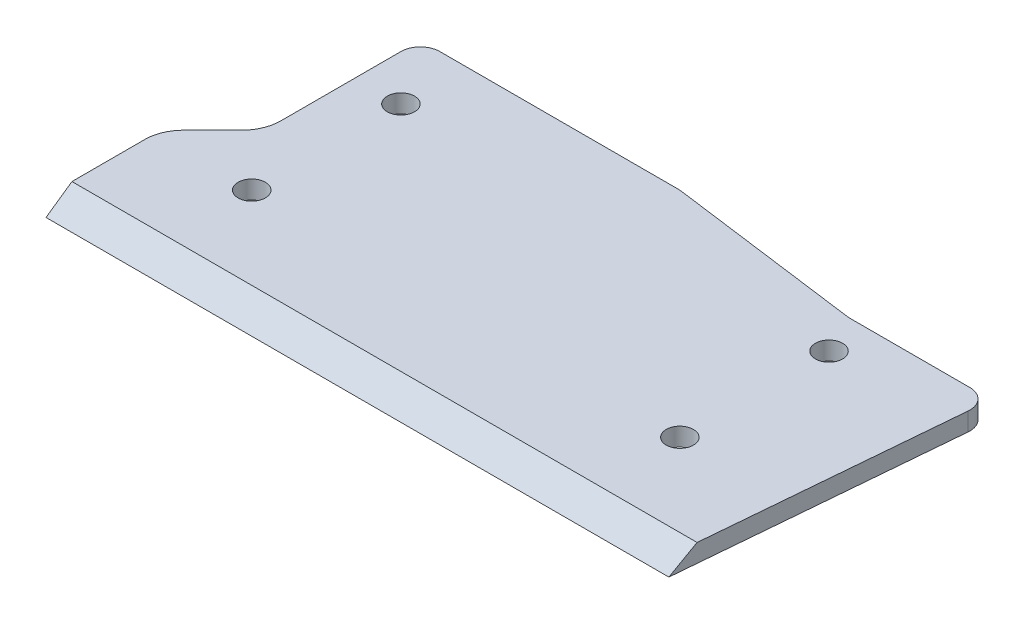
ISO-10303-21;
HEADER;
FILE_DESCRIPTION(('STEP AP214'),'2;1');
FILE_NAME('part.step','',(''),(''),'','','');
FILE_SCHEMA(('AUTOMOTIVE_DESIGN { 1 0 10303 214 1 1 1 1 }'));
ENDSEC;
DATA;
#1=APPLICATION_CONTEXT('core data for automotive mechanical design processes');
#2=APPLICATION_PROTOCOL_DEFINITION('international standard','automotive_design',2000,#1);
#3=PRODUCT_CONTEXT('',#1,'mechanical');
#4=PRODUCT('Part','Part','',(#3));
#5=PRODUCT_RELATED_PRODUCT_CATEGORY('part','',(#4));
#6=PRODUCT_DEFINITION_FORMATION('','',#4);
#7=PRODUCT_DEFINITION_CONTEXT('part definition',#1,'design');
#8=PRODUCT_DEFINITION('design','',#6,#7);
#9=PRODUCT_DEFINITION_SHAPE('','',#8);
#10=(LENGTH_UNIT() NAMED_UNIT(*) SI_UNIT(.MILLI.,.METRE.));
#11=(NAMED_UNIT(*) PLANE_ANGLE_UNIT() SI_UNIT($,.RADIAN.));
#12=(NAMED_UNIT(*) SI_UNIT($,.STERADIAN.) SOLID_ANGLE_UNIT());
#13=UNCERTAINTY_MEASURE_WITH_UNIT(LENGTH_MEASURE(1.E-05),#10,'distance_accuracy_value','');
#14=(GEOMETRIC_REPRESENTATION_CONTEXT(3) GLOBAL_UNCERTAINTY_ASSIGNED_CONTEXT((#13)) GLOBAL_UNIT_ASSIGNED_CONTEXT((#10,
#11,#12)) REPRESENTATION_CONTEXT('',''));
#15=CARTESIAN_POINT('',(0.,0.,0.));
#16=DIRECTION('',(0.,0.,1.));
#17=DIRECTION('',(1.,0.,0.));
#18=AXIS2_PLACEMENT_3D('',#15,#16,#17);
#19=CARTESIAN_POINT('',(0.,2.8,-4.));
#20=DIRECTION('',(1.,0.,0.));
#21=DIRECTION('',(0.,0.,-1.));
#22=AXIS2_PLACEMENT_3D('',#19,#20,#21);
#23=PLANE('',#22);
#24=DIRECTION('',(0.,0.,1.));
#25=VECTOR('',#24,1.);
#26=CARTESIAN_POINT('',(0.,2.8,-4.));
#27=LINE('',#26,#25);
#28=CARTESIAN_POINT('',(0.,2.8,-1.));
#29=VERTEX_POINT('',#28);
#30=CARTESIAN_POINT('',(0.,2.8,17.5147186257614));
#31=VERTEX_POINT('',#30);
#32=EDGE_CURVE('E172',#29,#31,#27,.T.);
#33=ORIENTED_EDGE('',*,*,#32,.F.);
#34=DIRECTION('',(0.,-1.,0.));
#35=VECTOR('',#34,1.);
#36=CARTESIAN_POINT('',(0.,2.8,-1.));
#37=LINE('',#36,#35);
#38=CARTESIAN_POINT('',(0.,0.,-1.));
#39=VERTEX_POINT('',#38);
#40=EDGE_CURVE('E202',#29,#39,#37,.T.);
#41=ORIENTED_EDGE('',*,*,#40,.T.);
#42=DIRECTION('',(0.,0.,1.));
#43=VECTOR('',#42,1.);
#44=CARTESIAN_POINT('',(0.,0.,-4.));
#45=LINE('',#44,#43);
#46=CARTESIAN_POINT('',(0.,0.,17.5147186257614));
#47=VERTEX_POINT('',#46);
#48=EDGE_CURVE('E155',#39,#47,#45,.T.);
#49=ORIENTED_EDGE('',*,*,#48,.T.);
#50=DIRECTION('',(0.,-1.,0.));
#51=VECTOR('',#50,1.);
#52=CARTESIAN_POINT('',(0.,2.8,17.5147186257614));
#53=LINE('',#52,#51);
#54=EDGE_CURVE('E178',#47,#31,#53,.F.);
#55=ORIENTED_EDGE('',*,*,#54,.T.);
#56=EDGE_LOOP('',(#33,#41,#49,#55));
#57=FACE_BOUND('',#56,.T.);
#58=ADVANCED_FACE('F39',(#57),#23,.F.);
#59=CARTESIAN_POINT('',(-8.,2.8,28.));
#60=DIRECTION('',(0.707106781186547,0.,0.707106781186547));
#61=DIRECTION('',(0.707106781186548,0.,-0.707106781186548));
#62=AXIS2_PLACEMENT_3D('',#59,#60,#61);
#63=PLANE('',#62);
#64=DIRECTION('',(-0.707106781186548,0.,0.707106781186548));
#65=VECTOR('',#64,1.);
#66=CARTESIAN_POINT('',(-8.,2.8,28.));
#67=LINE('',#66,#65);
#68=CARTESIAN_POINT('',(-1.75735931288071,2.8,21.7573593128807));
#69=VERTEX_POINT('',#68);
#70=CARTESIAN_POINT('',(-6.24264068711929,2.8,26.2426406871193));
#71=VERTEX_POINT('',#70);
#72=EDGE_CURVE('E236',#69,#71,#67,.T.);
#73=ORIENTED_EDGE('',*,*,#72,.F.);
#74=DIRECTION('',(0.,-1.,0.));
#75=VECTOR('',#74,1.);
#76=CARTESIAN_POINT('',(-1.75735931288072,0.,21.7573593128807));
#77=LINE('',#76,#75);
#78=CARTESIAN_POINT('',(-1.75735931288071,0.,21.7573593128807));
#79=VERTEX_POINT('',#78);
#80=EDGE_CURVE('E175',#69,#79,#77,.T.);
#81=ORIENTED_EDGE('',*,*,#80,.T.);
#82=DIRECTION('',(-0.707106781186548,0.,0.707106781186548));
#83=VECTOR('',#82,1.);
#84=CARTESIAN_POINT('',(-8.,0.,28.));
#85=LINE('',#84,#83);
#86=CARTESIAN_POINT('',(-6.24264068711929,0.,26.2426406871193));
#87=VERTEX_POINT('',#86);
#88=EDGE_CURVE('E157',#79,#87,#85,.T.);
#89=ORIENTED_EDGE('',*,*,#88,.T.);
#90=DIRECTION('',(0.,-1.,0.));
#91=VECTOR('',#90,1.);
#92=CARTESIAN_POINT('',(-6.24264068711929,2.8,26.2426406871193));
#93=LINE('',#92,#91);
#94=EDGE_CURVE('E144',#87,#71,#93,.F.);
#95=ORIENTED_EDGE('',*,*,#94,.T.);
#96=EDGE_LOOP('',(#73,#81,#89,#95));
#97=FACE_BOUND('',#96,.T.);
#98=ADVANCED_FACE('F239',(#97),#63,.F.);
#99=CARTESIAN_POINT('',(-8.,2.8,46.));
#100=DIRECTION('',(1.,0.,0.));
#101=DIRECTION('',(0.,0.,-1.));
#102=AXIS2_PLACEMENT_3D('',#99,#100,#101);
#103=PLANE('',#102);
#104=DIRECTION('',(0.,0.,1.));
#105=VECTOR('',#104,1.);
#106=CARTESIAN_POINT('',(-8.,0.,46.));
#107=LINE('',#106,#105);
#108=CARTESIAN_POINT('',(-8.,0.,30.4852813742386));
#109=VERTEX_POINT('',#108);
#110=CARTESIAN_POINT('',(-8.,0.,45.7143703986515));
#111=VERTEX_POINT('',#110);
#112=EDGE_CURVE('E161',#109,#111,#107,.T.);
#113=ORIENTED_EDGE('',*,*,#112,.T.);
#114=DIRECTION('',(0.,-0.573576436351042,0.819152044288995));
#115=VECTOR('',#114,1.);
#116=CARTESIAN_POINT('',(-8.,2.8,41.7155559797736));
#117=LINE('',#116,#115);
#118=CARTESIAN_POINT('',(-8.,2.8,41.7155559797736));
#119=VERTEX_POINT('',#118);
#120=EDGE_CURVE('E200',#111,#119,#117,.F.);
#121=ORIENTED_EDGE('',*,*,#120,.T.);
#122=DIRECTION('',(0.,0.,1.));
#123=VECTOR('',#122,1.);
#124=CARTESIAN_POINT('',(-8.,2.8,46.));
#125=LINE('',#124,#123);
#126=CARTESIAN_POINT('',(-8.,2.8,30.4852813742386));
#127=VERTEX_POINT('',#126);
#128=EDGE_CURVE('E241',#127,#119,#125,.T.);
#129=ORIENTED_EDGE('',*,*,#128,.F.);
#130=DIRECTION('',(0.,-1.,0.));
#131=VECTOR('',#130,1.);
#132=CARTESIAN_POINT('',(-8.,2.8,30.4852813742386));
#133=LINE('',#132,#131);
#134=EDGE_CURVE('E181',#127,#109,#133,.T.);
#135=ORIENTED_EDGE('',*,*,#134,.T.);
#136=EDGE_LOOP('',(#113,#121,#129,#135));
#137=FACE_BOUND('',#136,.T.);
#138=ADVANCED_FACE('F258',(#137),#103,.F.);
#139=CARTESIAN_POINT('',(92.,2.8,0.));
#140=DIRECTION('',(-0.996240588195683,0.,-0.0866296163648421));
#141=DIRECTION('',(-0.0866296163648421,0.,0.996240588195683));
#142=AXIS2_PLACEMENT_3D('',#139,#140,#141);
#143=PLANE('',#142);
#144=DIRECTION('',(0.0866296163648421,0.,-0.996240588195683));
#145=VECTOR('',#144,1.);
#146=CARTESIAN_POINT('',(92.,0.,0.));
#147=LINE('',#146,#145);
#148=CARTESIAN_POINT('',(88.024837356639,0.,45.7143703986515));
#149=VERTEX_POINT('',#148);
#150=CARTESIAN_POINT('',(91.7165314044266,0.,3.25988884909453));
#151=VERTEX_POINT('',#150);
#152=EDGE_CURVE('E164',#149,#151,#147,.T.);
#153=ORIENTED_EDGE('',*,*,#152,.T.);
#154=DIRECTION('',(0.,-1.,0.));
#155=VECTOR('',#154,1.);
#156=CARTESIAN_POINT('',(91.7165314044266,2.8,3.25988884909453));
#157=LINE('',#156,#155);
#158=CARTESIAN_POINT('',(91.7165314044266,2.8,3.25988884909453));
#159=VERTEX_POINT('',#158);
#160=EDGE_CURVE('E11',#151,#159,#157,.F.);
#161=ORIENTED_EDGE('',*,*,#160,.T.);
#162=DIRECTION('',(0.0866296163648421,0.,-0.996240588195683));
#163=VECTOR('',#162,1.);
#164=CARTESIAN_POINT('',(92.,2.8,0.));
#165=LINE('',#164,#163);
#166=CARTESIAN_POINT('',(88.3725603495849,2.8,41.7155559797736));
#167=VERTEX_POINT('',#166);
#168=EDGE_CURVE('E135',#167,#159,#165,.T.);
#169=ORIENTED_EDGE('',*,*,#168,.F.);
#170=DIRECTION('',(0.0710505923510257,0.572126844122207,-0.817081812036795));
#171=VECTOR('',#170,1.);
#172=CARTESIAN_POINT('',(87.9264391681311,-0.792340263403206,46.8459495664924));
#173=LINE('',#172,#171);
#174=EDGE_CURVE('E196',#167,#149,#173,.F.);
#175=ORIENTED_EDGE('',*,*,#174,.T.);
#176=EDGE_LOOP('',(#153,#161,#169,#175));
#177=FACE_BOUND('',#176,.T.);
#178=ADVANCED_FACE('F282',(#177),#143,.F.);
#179=CARTESIAN_POINT('',(70.,2.8,0.));
#180=DIRECTION('',(0.,0.,1.));
#181=DIRECTION('',(1.,0.,0.));
#182=AXIS2_PLACEMENT_3D('',#179,#180,#181);
#183=PLANE('',#182);
#184=DIRECTION('',(-1.,0.,0.));
#185=VECTOR('',#184,1.);
#186=CARTESIAN_POINT('',(70.,2.8,0.));
#187=LINE('',#186,#185);
#188=CARTESIAN_POINT('',(88.7278096398395,2.8,0.));
#189=VERTEX_POINT('',#188);
#190=CARTESIAN_POINT('',(70.,2.8,0.));
#191=VERTEX_POINT('',#190);
#192=EDGE_CURVE('E125',#189,#191,#187,.T.);
#193=ORIENTED_EDGE('',*,*,#192,.F.);
#194=DIRECTION('',(0.,-1.,0.));
#195=VECTOR('',#194,1.);
#196=CARTESIAN_POINT('',(88.7278096398395,2.8,0.));
#197=LINE('',#196,#195);
#198=CARTESIAN_POINT('',(88.7278096398395,0.,0.));
#199=VERTEX_POINT('',#198);
#200=EDGE_CURVE('E47',#189,#199,#197,.T.);
#201=ORIENTED_EDGE('',*,*,#200,.T.);
#202=DIRECTION('',(-1.,0.,0.));
#203=VECTOR('',#202,1.);
#204=CARTESIAN_POINT('',(70.,0.,0.));
#205=LINE('',#204,#203);
#206=CARTESIAN_POINT('',(70.,0.,0.));
#207=VERTEX_POINT('',#206);
#208=EDGE_CURVE('E141',#199,#207,#205,.T.);
#209=ORIENTED_EDGE('',*,*,#208,.T.);
#210=DIRECTION('',(0.,-1.,0.));
#211=VECTOR('',#210,1.);
#212=CARTESIAN_POINT('',(70.,2.8,0.));
#213=LINE('',#212,#211);
#214=EDGE_CURVE('E138',#191,#207,#213,.T.);
#215=ORIENTED_EDGE('',*,*,#214,.F.);
#216=EDGE_LOOP('',(#193,#201,#209,#215));
#217=FACE_BOUND('',#216,.T.);
#218=ADVANCED_FACE('F139',(#217),#183,.F.);
#219=CARTESIAN_POINT('',(40.,2.8,-4.));
#220=DIRECTION('',(-0.132163720091018,0.,0.991227900682635));
#221=DIRECTION('',(0.991227900682635,0.,0.132163720091018));
#222=AXIS2_PLACEMENT_3D('',#219,#220,#221);
#223=PLANE('',#222);
#224=DIRECTION('',(-0.991227900682635,0.,-0.132163720091018));
#225=VECTOR('',#224,1.);
#226=CARTESIAN_POINT('',(40.,0.,-4.));
#227=LINE('',#226,#225);
#228=CARTESIAN_POINT('',(40.,0.,-4.));
#229=VERTEX_POINT('',#228);
#230=EDGE_CURVE('E167',#207,#229,#227,.T.);
#231=ORIENTED_EDGE('',*,*,#230,.T.);
#232=DIRECTION('',(0.,-1.,0.));
#233=VECTOR('',#232,1.);
#234=CARTESIAN_POINT('',(40.,2.8,-4.));
#235=LINE('',#234,#233);
#236=CARTESIAN_POINT('',(40.,2.8,-4.));
#237=VERTEX_POINT('',#236);
#238=EDGE_CURVE('E145',#237,#229,#235,.T.);
#239=ORIENTED_EDGE('',*,*,#238,.F.);
#240=DIRECTION('',(-0.991227900682635,0.,-0.132163720091018));
#241=VECTOR('',#240,1.);
#242=CARTESIAN_POINT('',(40.,2.8,-4.));
#243=LINE('',#242,#241);
#244=EDGE_CURVE('E130',#191,#237,#243,.T.);
#245=ORIENTED_EDGE('',*,*,#244,.F.);
#246=ORIENTED_EDGE('',*,*,#214,.T.);
#247=EDGE_LOOP('',(#231,#239,#245,#246));
#248=FACE_BOUND('',#247,.T.);
#249=ADVANCED_FACE('F147',(#248),#223,.F.);
#250=CARTESIAN_POINT('',(0.,2.8,-4.));
#251=DIRECTION('',(0.,0.,1.));
#252=DIRECTION('',(1.,0.,0.));
#253=AXIS2_PLACEMENT_3D('',#250,#251,#252);
#254=PLANE('',#253);
#255=DIRECTION('',(-1.,0.,0.));
#256=VECTOR('',#255,1.);
#257=CARTESIAN_POINT('',(0.,0.,-4.));
#258=LINE('',#257,#256);
#259=CARTESIAN_POINT('',(3.,0.,-4.));
#260=VERTEX_POINT('',#259);
#261=EDGE_CURVE('E169',#229,#260,#258,.T.);
#262=ORIENTED_EDGE('',*,*,#261,.T.);
#263=DIRECTION('',(0.,-1.,0.));
#264=VECTOR('',#263,1.);
#265=CARTESIAN_POINT('',(3.,2.8,-4.));
#266=LINE('',#265,#264);
#267=CARTESIAN_POINT('',(3.,2.8,-4.));
#268=VERTEX_POINT('',#267);
#269=EDGE_CURVE('E209',#260,#268,#266,.F.);
#270=ORIENTED_EDGE('',*,*,#269,.T.);
#271=DIRECTION('',(-1.,0.,0.));
#272=VECTOR('',#271,1.);
#273=CARTESIAN_POINT('',(0.,2.8,-4.));
#274=LINE('',#273,#272);
#275=EDGE_CURVE('E150',#237,#268,#274,.T.);
#276=ORIENTED_EDGE('',*,*,#275,.F.);
#277=ORIENTED_EDGE('',*,*,#238,.T.);
#278=EDGE_LOOP('',(#262,#270,#276,#277));
#279=FACE_BOUND('',#278,.T.);
#280=ADVANCED_FACE('F220',(#279),#254,.F.);
#281=CARTESIAN_POINT('',(0.,2.8,0.));
#282=DIRECTION('',(0.,-1.,0.));
#283=DIRECTION('',(0.,0.,-1.));
#284=AXIS2_PLACEMENT_3D('',#281,#282,#283);
#285=PLANE('',#284);
#286=CARTESIAN_POINT('',(7.00000000000001,2.8,29.));
#287=DIRECTION('',(0.,1.,0.));
#288=DIRECTION('',(0.,0.,1.));
#289=AXIS2_PLACEMENT_3D('',#286,#287,#288);
#290=CIRCLE('',#289,2.1);
#291=CARTESIAN_POINT('',(7.00000000000001,2.8,31.1));
#292=VERTEX_POINT('',#291);
#293=EDGE_CURVE('E333',#292,#292,#290,.T.);
#294=ORIENTED_EDGE('',*,*,#293,.F.);
#295=EDGE_LOOP('',(#294));
#296=FACE_BOUND('',#295,.T.);
#297=CARTESIAN_POINT('',(73.,2.8,6.));
#298=DIRECTION('',(0.,1.,0.));
#299=DIRECTION('',(0.,0.,1.));
#300=AXIS2_PLACEMENT_3D('',#297,#298,#299);
#301=CIRCLE('',#300,2.1);
#302=CARTESIAN_POINT('',(73.,2.8,8.1));
#303=VERTEX_POINT('',#302);
#304=EDGE_CURVE('E326',#303,#303,#301,.T.);
#305=ORIENTED_EDGE('',*,*,#304,.F.);
#306=EDGE_LOOP('',(#305));
#307=FACE_BOUND('',#306,.T.);
#308=CARTESIAN_POINT('',(73.,2.8,29.));
#309=DIRECTION('',(0.,1.,0.));
#310=DIRECTION('',(0.,0.,1.));
#311=AXIS2_PLACEMENT_3D('',#308,#309,#310);
#312=CIRCLE('',#311,2.1);
#313=CARTESIAN_POINT('',(73.,2.8,31.1));
#314=VERTEX_POINT('',#313);
#315=EDGE_CURVE('E323',#314,#314,#312,.T.);
#316=ORIENTED_EDGE('',*,*,#315,.F.);
#317=EDGE_LOOP('',(#316));
#318=FACE_BOUND('',#317,.T.);
#319=CARTESIAN_POINT('',(7.00000000000001,2.8,6.));
#320=DIRECTION('',(0.,1.,0.));
#321=DIRECTION('',(0.,0.,1.));
#322=AXIS2_PLACEMENT_3D('',#319,#320,#321);
#323=CIRCLE('',#322,2.1);
#324=CARTESIAN_POINT('',(7.00000000000001,2.8,8.1));
#325=VERTEX_POINT('',#324);
#326=EDGE_CURVE('E332',#325,#325,#323,.T.);
#327=ORIENTED_EDGE('',*,*,#326,.F.);
#328=EDGE_LOOP('',(#327));
#329=FACE_BOUND('',#328,.T.);
#330=ORIENTED_EDGE('',*,*,#275,.T.);
#331=CARTESIAN_POINT('',(3.,2.8,-1.));
#332=DIRECTION('',(0.,-1.,0.));
#333=DIRECTION('',(0.,0.,-1.));
#334=AXIS2_PLACEMENT_3D('',#331,#332,#333);
#335=CIRCLE('',#334,3.);
#336=EDGE_CURVE('E212',#268,#29,#335,.F.);
#337=ORIENTED_EDGE('',*,*,#336,.T.);
#338=ORIENTED_EDGE('',*,*,#32,.T.);
#339=CARTESIAN_POINT('',(-6.,2.8,17.5147186257614));
#340=DIRECTION('',(0.,-1.,0.));
#341=DIRECTION('',(0.,0.,-1.));
#342=AXIS2_PLACEMENT_3D('',#339,#340,#341);
#343=CIRCLE('',#342,6.);
#344=EDGE_CURVE('E191',#31,#69,#343,.T.);
#345=ORIENTED_EDGE('',*,*,#344,.T.);
#346=ORIENTED_EDGE('',*,*,#72,.T.);
#347=CARTESIAN_POINT('',(-2.,2.8,30.4852813742386));
#348=DIRECTION('',(0.,-1.,0.));
#349=DIRECTION('',(0.,0.,-1.));
#350=AXIS2_PLACEMENT_3D('',#347,#348,#349);
#351=CIRCLE('',#350,6.);
#352=EDGE_CURVE('E186',#71,#127,#351,.F.);
#353=ORIENTED_EDGE('',*,*,#352,.T.);
#354=ORIENTED_EDGE('',*,*,#128,.T.);
#355=DIRECTION('',(1.,0.,0.));
#356=VECTOR('',#355,1.);
#357=CARTESIAN_POINT('',(0.,2.8,41.7155559797736));
#358=LINE('',#357,#356);
#359=EDGE_CURVE('E193',#119,#167,#358,.T.);
#360=ORIENTED_EDGE('',*,*,#359,.T.);
#361=ORIENTED_EDGE('',*,*,#168,.T.);
#362=CARTESIAN_POINT('',(88.7278096398395,2.8,3.));
#363=DIRECTION('',(0.,-1.,0.));
#364=DIRECTION('',(0.,0.,-1.));
#365=AXIS2_PLACEMENT_3D('',#362,#363,#364);
#366=CIRCLE('',#365,3.);
#367=EDGE_CURVE('E54',#159,#189,#366,.F.);
#368=ORIENTED_EDGE('',*,*,#367,.T.);
#369=ORIENTED_EDGE('',*,*,#192,.T.);
#370=ORIENTED_EDGE('',*,*,#244,.T.);
#371=EDGE_LOOP('',(#330,#337,#338,#345,#346,#353,#354,#360,#361,#368,#369,#370));
#372=FACE_BOUND('',#371,.T.);
#373=ADVANCED_FACE('F128',(#296,#307,#318,#329,#372),#285,.F.);
#374=CARTESIAN_POINT('',(0.,0.,0.));
#375=DIRECTION('',(0.,-1.,0.));
#376=DIRECTION('',(0.,0.,-1.));
#377=AXIS2_PLACEMENT_3D('',#374,#375,#376);
#378=PLANE('',#377);
#379=CARTESIAN_POINT('',(7.00000000000001,0.,29.));
#380=DIRECTION('',(0.,1.,0.));
#381=DIRECTION('',(0.,0.,1.));
#382=AXIS2_PLACEMENT_3D('',#379,#380,#381);
#383=CIRCLE('',#382,2.1);
#384=CARTESIAN_POINT('',(7.00000000000001,0.,31.1));
#385=VERTEX_POINT('',#384);
#386=EDGE_CURVE('E329',#385,#385,#383,.T.);
#387=ORIENTED_EDGE('',*,*,#386,.T.);
#388=EDGE_LOOP('',(#387));
#389=FACE_BOUND('',#388,.T.);
#390=CARTESIAN_POINT('',(73.,0.,6.));
#391=DIRECTION('',(0.,1.,0.));
#392=DIRECTION('',(0.,0.,1.));
#393=AXIS2_PLACEMENT_3D('',#390,#391,#392);
#394=CIRCLE('',#393,2.1);
#395=CARTESIAN_POINT('',(73.,0.,8.1));
#396=VERTEX_POINT('',#395);
#397=EDGE_CURVE('E336',#396,#396,#394,.T.);
#398=ORIENTED_EDGE('',*,*,#397,.T.);
#399=EDGE_LOOP('',(#398));
#400=FACE_BOUND('',#399,.T.);
#401=CARTESIAN_POINT('',(73.,0.,29.));
#402=DIRECTION('',(0.,1.,0.));
#403=DIRECTION('',(0.,0.,1.));
#404=AXIS2_PLACEMENT_3D('',#401,#402,#403);
#405=CIRCLE('',#404,2.1);
#406=CARTESIAN_POINT('',(73.,0.,31.1));
#407=VERTEX_POINT('',#406);
#408=EDGE_CURVE('E320',#407,#407,#405,.T.);
#409=ORIENTED_EDGE('',*,*,#408,.T.);
#410=EDGE_LOOP('',(#409));
#411=FACE_BOUND('',#410,.T.);
#412=CARTESIAN_POINT('',(7.00000000000001,0.,6.));
#413=DIRECTION('',(0.,1.,0.));
#414=DIRECTION('',(0.,0.,1.));
#415=AXIS2_PLACEMENT_3D('',#412,#413,#414);
#416=CIRCLE('',#415,2.1);
#417=CARTESIAN_POINT('',(7.00000000000001,0.,8.1));
#418=VERTEX_POINT('',#417);
#419=EDGE_CURVE('E158',#418,#418,#416,.T.);
#420=ORIENTED_EDGE('',*,*,#419,.T.);
#421=EDGE_LOOP('',(#420));
#422=FACE_BOUND('',#421,.T.);
#423=ORIENTED_EDGE('',*,*,#48,.F.);
#424=CARTESIAN_POINT('',(3.,0.,-1.));
#425=DIRECTION('',(0.,-1.,0.));
#426=DIRECTION('',(0.,0.,-1.));
#427=AXIS2_PLACEMENT_3D('',#424,#425,#426);
#428=CIRCLE('',#427,3.);
#429=EDGE_CURVE('E207',#39,#260,#428,.T.);
#430=ORIENTED_EDGE('',*,*,#429,.T.);
#431=ORIENTED_EDGE('',*,*,#261,.F.);
#432=ORIENTED_EDGE('',*,*,#230,.F.);
#433=ORIENTED_EDGE('',*,*,#208,.F.);
#434=CARTESIAN_POINT('',(88.7278096398395,0.,3.));
#435=DIRECTION('',(0.,-1.,0.));
#436=DIRECTION('',(0.,0.,-1.));
#437=AXIS2_PLACEMENT_3D('',#434,#435,#436);
#438=CIRCLE('',#437,3.);
#439=EDGE_CURVE('E205',#199,#151,#438,.T.);
#440=ORIENTED_EDGE('',*,*,#439,.T.);
#441=ORIENTED_EDGE('',*,*,#152,.F.);
#442=DIRECTION('',(1.,0.,0.));
#443=VECTOR('',#442,1.);
#444=CARTESIAN_POINT('',(0.,0.,45.7143703986515));
#445=LINE('',#444,#443);
#446=EDGE_CURVE('E198',#149,#111,#445,.F.);
#447=ORIENTED_EDGE('',*,*,#446,.T.);
#448=ORIENTED_EDGE('',*,*,#112,.F.);
#449=CARTESIAN_POINT('',(-2.,0.,30.4852813742386));
#450=DIRECTION('',(0.,-1.,0.));
#451=DIRECTION('',(0.,0.,-1.));
#452=AXIS2_PLACEMENT_3D('',#449,#450,#451);
#453=CIRCLE('',#452,6.);
#454=EDGE_CURVE('E184',#109,#87,#453,.T.);
#455=ORIENTED_EDGE('',*,*,#454,.T.);
#456=ORIENTED_EDGE('',*,*,#88,.F.);
#457=CARTESIAN_POINT('',(-6.,0.,17.5147186257614));
#458=DIRECTION('',(0.,-1.,0.));
#459=DIRECTION('',(0.,0.,-1.));
#460=AXIS2_PLACEMENT_3D('',#457,#458,#459);
#461=CIRCLE('',#460,6.);
#462=EDGE_CURVE('E188',#79,#47,#461,.F.);
#463=ORIENTED_EDGE('',*,*,#462,.T.);
#464=EDGE_LOOP('',(#423,#430,#431,#432,#433,#440,#441,#447,#448,#455,#456,#463));
#465=FACE_BOUND('',#464,.T.);
#466=ADVANCED_FACE('F216',(#389,#400,#411,#422,#465),#378,.T.);
#467=CARTESIAN_POINT('',(7.00000000000001,0.,6.));
#468=DIRECTION('',(0.,1.,0.));
#469=DIRECTION('',(0.,0.,1.));
#470=AXIS2_PLACEMENT_3D('',#467,#468,#469);
#471=CYLINDRICAL_SURFACE('',#470,2.1);
#472=ORIENTED_EDGE('',*,*,#419,.F.);
#473=EDGE_LOOP('',(#472));
#474=FACE_BOUND('',#473,.T.);
#475=ORIENTED_EDGE('',*,*,#326,.T.);
#476=EDGE_LOOP('',(#475));
#477=FACE_BOUND('',#476,.T.);
#478=ADVANCED_FACE('F297',(#474,#477),#471,.F.);
#479=CARTESIAN_POINT('',(73.,0.,29.));
#480=DIRECTION('',(0.,1.,0.));
#481=DIRECTION('',(0.,0.,1.));
#482=AXIS2_PLACEMENT_3D('',#479,#480,#481);
#483=CYLINDRICAL_SURFACE('',#482,2.1);
#484=ORIENTED_EDGE('',*,*,#408,.F.);
#485=EDGE_LOOP('',(#484));
#486=FACE_BOUND('',#485,.T.);
#487=ORIENTED_EDGE('',*,*,#315,.T.);
#488=EDGE_LOOP('',(#487));
#489=FACE_BOUND('',#488,.T.);
#490=ADVANCED_FACE('F304',(#486,#489),#483,.F.);
#491=CARTESIAN_POINT('',(73.,0.,6.));
#492=DIRECTION('',(0.,1.,0.));
#493=DIRECTION('',(0.,0.,1.));
#494=AXIS2_PLACEMENT_3D('',#491,#492,#493);
#495=CYLINDRICAL_SURFACE('',#494,2.1);
#496=ORIENTED_EDGE('',*,*,#397,.F.);
#497=EDGE_LOOP('',(#496));
#498=FACE_BOUND('',#497,.T.);
#499=ORIENTED_EDGE('',*,*,#304,.T.);
#500=EDGE_LOOP('',(#499));
#501=FACE_BOUND('',#500,.T.);
#502=ADVANCED_FACE('F306',(#498,#501),#495,.F.);
#503=CARTESIAN_POINT('',(7.00000000000001,0.,29.));
#504=DIRECTION('',(0.,1.,0.));
#505=DIRECTION('',(0.,0.,1.));
#506=AXIS2_PLACEMENT_3D('',#503,#504,#505);
#507=CYLINDRICAL_SURFACE('',#506,2.1);
#508=ORIENTED_EDGE('',*,*,#386,.F.);
#509=EDGE_LOOP('',(#508));
#510=FACE_BOUND('',#509,.T.);
#511=ORIENTED_EDGE('',*,*,#293,.T.);
#512=EDGE_LOOP('',(#511));
#513=FACE_BOUND('',#512,.T.);
#514=ADVANCED_FACE('F265',(#510,#513),#507,.F.);
#515=CARTESIAN_POINT('',(-6.,2.8,17.5147186257614));
#516=DIRECTION('',(0.,1.,0.));
#517=DIRECTION('',(0.,0.,1.));
#518=AXIS2_PLACEMENT_3D('',#515,#516,#517);
#519=CYLINDRICAL_SURFACE('',#518,6.);
#520=ORIENTED_EDGE('',*,*,#344,.F.);
#521=ORIENTED_EDGE('',*,*,#54,.F.);
#522=ORIENTED_EDGE('',*,*,#462,.F.);
#523=ORIENTED_EDGE('',*,*,#80,.F.);
#524=EDGE_LOOP('',(#520,#521,#522,#523));
#525=FACE_BOUND('',#524,.T.);
#526=ADVANCED_FACE('F233',(#525),#519,.F.);
#527=CARTESIAN_POINT('',(-2.,2.8,30.4852813742386));
#528=DIRECTION('',(0.,-1.,0.));
#529=DIRECTION('',(0.,0.,-1.));
#530=AXIS2_PLACEMENT_3D('',#527,#528,#529);
#531=CYLINDRICAL_SURFACE('',#530,6.);
#532=ORIENTED_EDGE('',*,*,#352,.F.);
#533=ORIENTED_EDGE('',*,*,#94,.F.);
#534=ORIENTED_EDGE('',*,*,#454,.F.);
#535=ORIENTED_EDGE('',*,*,#134,.F.);
#536=EDGE_LOOP('',(#532,#533,#534,#535));
#537=FACE_BOUND('',#536,.T.);
#538=ADVANCED_FACE('F264',(#537),#531,.T.);
#539=CARTESIAN_POINT('',(0.,2.8,41.7155559797736));
#540=DIRECTION('',(0.,-0.819152044288994,-0.573576436351042));
#541=DIRECTION('',(1.,0.,0.));
#542=AXIS2_PLACEMENT_3D('',#539,#540,#541);
#543=PLANE('',#542);
#544=ORIENTED_EDGE('',*,*,#120,.F.);
#545=ORIENTED_EDGE('',*,*,#446,.F.);
#546=ORIENTED_EDGE('',*,*,#174,.F.);
#547=ORIENTED_EDGE('',*,*,#359,.F.);
#548=EDGE_LOOP('',(#544,#545,#546,#547));
#549=FACE_BOUND('',#548,.T.);
#550=ADVANCED_FACE('F252',(#549),#543,.F.);
#551=CARTESIAN_POINT('',(3.,2.8,-1.));
#552=DIRECTION('',(0.,-1.,0.));
#553=DIRECTION('',(0.,0.,-1.));
#554=AXIS2_PLACEMENT_3D('',#551,#552,#553);
#555=CYLINDRICAL_SURFACE('',#554,3.);
#556=ORIENTED_EDGE('',*,*,#336,.F.);
#557=ORIENTED_EDGE('',*,*,#269,.F.);
#558=ORIENTED_EDGE('',*,*,#429,.F.);
#559=ORIENTED_EDGE('',*,*,#40,.F.);
#560=EDGE_LOOP('',(#556,#557,#558,#559));
#561=FACE_BOUND('',#560,.T.);
#562=ADVANCED_FACE('F226',(#561),#555,.T.);
#563=CARTESIAN_POINT('',(88.7278096398395,2.8,3.));
#564=DIRECTION('',(0.,-1.,0.));
#565=DIRECTION('',(0.,0.,-1.));
#566=AXIS2_PLACEMENT_3D('',#563,#564,#565);
#567=CYLINDRICAL_SURFACE('',#566,3.);
#568=ORIENTED_EDGE('',*,*,#367,.F.);
#569=ORIENTED_EDGE('',*,*,#160,.F.);
#570=ORIENTED_EDGE('',*,*,#439,.F.);
#571=ORIENTED_EDGE('',*,*,#200,.F.);
#572=EDGE_LOOP('',(#568,#569,#570,#571));
#573=FACE_BOUND('',#572,.T.);
#574=ADVANCED_FACE('F41',(#573),#567,.T.);
#575=CLOSED_SHELL('',(#58,#98,#138,#178,#218,#249,#280,#373,#466,#478,#490,#502,#514,#526,#538,
#550,#562,#574));
#576=MANIFOLD_SOLID_BREP('B2',#575);
#577=ADVANCED_BREP_SHAPE_REPRESENTATION('',(#18,#576),#14);
#578=SHAPE_DEFINITION_REPRESENTATION(#9,#577);
ENDSEC;
END-ISO-10303-21;
